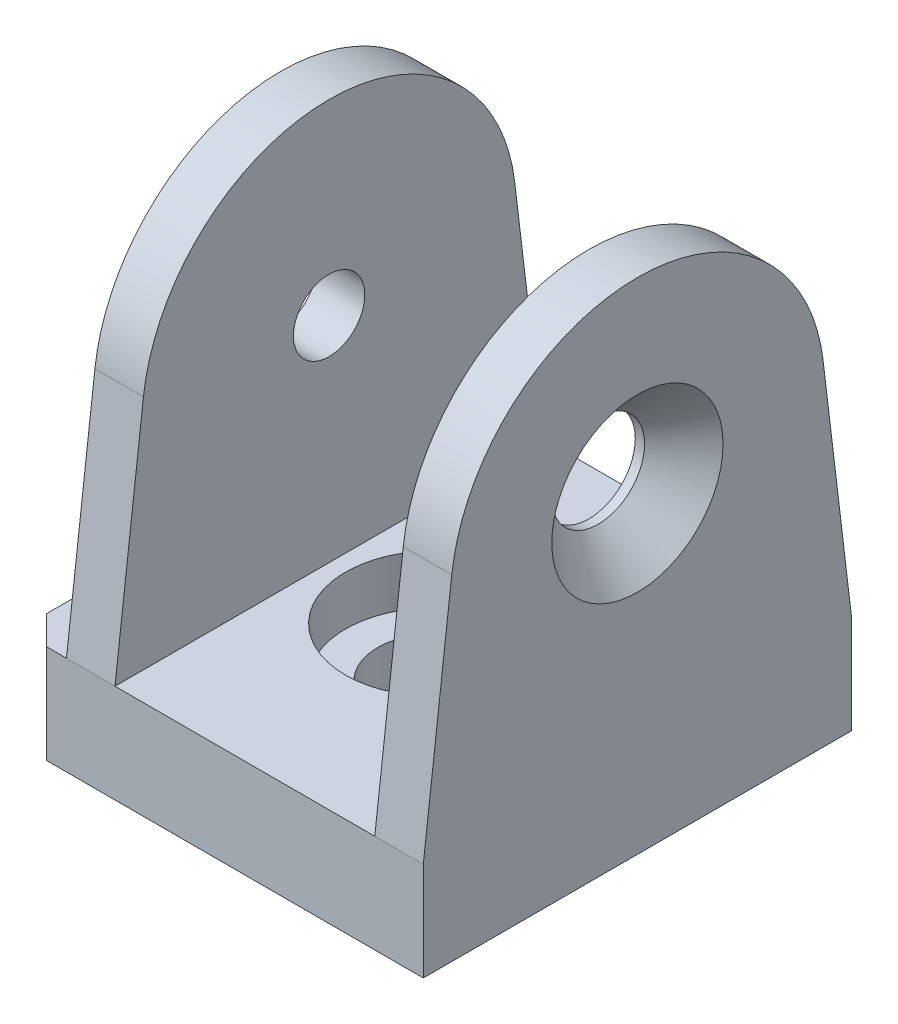
ISO-10303-21;
HEADER;
FILE_DESCRIPTION(('STEP AP214'),'2;1');
FILE_NAME('part.step','',(''),(''),'','','');
FILE_SCHEMA(('AUTOMOTIVE_DESIGN { 1 0 10303 214 1 1 1 1 }'));
ENDSEC;
DATA;
#1=APPLICATION_CONTEXT('core data for automotive mechanical design processes');
#2=APPLICATION_PROTOCOL_DEFINITION('international standard','automotive_design',2000,#1);
#3=PRODUCT_CONTEXT('',#1,'mechanical');
#4=PRODUCT('Part','Part','',(#3));
#5=PRODUCT_RELATED_PRODUCT_CATEGORY('part','',(#4));
#6=PRODUCT_DEFINITION_FORMATION('','',#4);
#7=PRODUCT_DEFINITION_CONTEXT('part definition',#1,'design');
#8=PRODUCT_DEFINITION('design','',#6,#7);
#9=PRODUCT_DEFINITION_SHAPE('','',#8);
#10=(LENGTH_UNIT() NAMED_UNIT(*) SI_UNIT(.MILLI.,.METRE.));
#11=(NAMED_UNIT(*) PLANE_ANGLE_UNIT() SI_UNIT($,.RADIAN.));
#12=(NAMED_UNIT(*) SI_UNIT($,.STERADIAN.) SOLID_ANGLE_UNIT());
#13=UNCERTAINTY_MEASURE_WITH_UNIT(LENGTH_MEASURE(1.E-05),#10,'distance_accuracy_value','');
#14=(GEOMETRIC_REPRESENTATION_CONTEXT(3) GLOBAL_UNCERTAINTY_ASSIGNED_CONTEXT((#13)) GLOBAL_UNIT_ASSIGNED_CONTEXT((#10,
#11,#12)) REPRESENTATION_CONTEXT('',''));
#15=CARTESIAN_POINT('',(0.,0.,0.));
#16=DIRECTION('',(0.,0.,1.));
#17=DIRECTION('',(1.,0.,0.));
#18=AXIS2_PLACEMENT_3D('',#15,#16,#17);
#19=CARTESIAN_POINT('',(-10.8,23.4654601413375,-13.0061268080041));
#20=DIRECTION('',(0.,0.119500774147898,-0.992834107481231));
#21=DIRECTION('',(0.,0.992834107481231,0.119500774147898));
#22=AXIS2_PLACEMENT_3D('',#19,#20,#21);
#23=PLANE('',#22);
#24=DIRECTION('',(0.,-0.992834107481231,-0.119500774147898));
#25=VECTOR('',#24,1.);
#26=CARTESIAN_POINT('',(10.8,23.4654601413375,-13.0061268080041));
#27=LINE('',#26,#25);
#28=CARTESIAN_POINT('',(10.8,23.4654601413374,-13.0061268080041));
#29=VERTEX_POINT('',#28);
#30=CARTESIAN_POINT('',(10.8,6.9,-15.));
#31=VERTEX_POINT('',#30);
#32=EDGE_CURVE('E145',#29,#31,#27,.T.);
#33=ORIENTED_EDGE('',*,*,#32,.F.);
#34=DIRECTION('',(1.,0.,0.));
#35=VECTOR('',#34,1.);
#36=CARTESIAN_POINT('',(-10.8,23.4654601413374,-13.0061268080041));
#37=LINE('',#36,#35);
#38=CARTESIAN_POINT('',(14.2,23.4654601413374,-13.0061268080041));
#39=VERTEX_POINT('',#38);
#40=EDGE_CURVE('E190',#29,#39,#37,.T.);
#41=ORIENTED_EDGE('',*,*,#40,.T.);
#42=DIRECTION('',(0.,0.992834107481231,0.119500774147898));
#43=VECTOR('',#42,1.);
#44=CARTESIAN_POINT('',(14.2,23.4654601413375,-13.0061268080041));
#45=LINE('',#44,#43);
#46=CARTESIAN_POINT('',(14.2,6.9,-15.));
#47=VERTEX_POINT('',#46);
#48=EDGE_CURVE('E258',#47,#39,#45,.T.);
#49=ORIENTED_EDGE('',*,*,#48,.F.);
#50=DIRECTION('',(-1.,0.,0.));
#51=VECTOR('',#50,1.);
#52=CARTESIAN_POINT('',(14.2,6.9,-15.));
#53=LINE('',#52,#51);
#54=EDGE_CURVE('E211',#47,#31,#53,.T.);
#55=ORIENTED_EDGE('',*,*,#54,.T.);
#56=EDGE_LOOP('',(#33,#41,#49,#55));
#57=FACE_BOUND('',#56,.T.);
#58=ADVANCED_FACE('F39',(#57),#23,.T.);
#59=CARTESIAN_POINT('',(-10.8,21.9,0.));
#60=DIRECTION('',(1.,0.,0.));
#61=DIRECTION('',(0.,0.,-1.));
#62=AXIS2_PLACEMENT_3D('',#59,#60,#61);
#63=CYLINDRICAL_SURFACE('',#62,13.1);
#64=DIRECTION('',(1.,0.,0.));
#65=VECTOR('',#64,1.);
#66=CARTESIAN_POINT('',(-10.8,23.4654601413375,13.0061268080041));
#67=LINE('',#66,#65);
#68=CARTESIAN_POINT('',(-10.8,23.4654601413375,13.0061268080041));
#69=VERTEX_POINT('',#68);
#70=CARTESIAN_POINT('',(-7.4,23.4654601413375,13.0061268080041));
#71=VERTEX_POINT('',#70);
#72=EDGE_CURVE('E178',#69,#71,#67,.T.);
#73=ORIENTED_EDGE('',*,*,#72,.T.);
#74=CARTESIAN_POINT('',(-7.4,21.9,0.));
#75=DIRECTION('',(-1.,0.,0.));
#76=DIRECTION('',(0.,-1.,0.));
#77=AXIS2_PLACEMENT_3D('',#74,#75,#76);
#78=CIRCLE('',#77,13.1);
#79=CARTESIAN_POINT('',(-7.4,23.4654601413374,-13.0061268080041));
#80=VERTEX_POINT('',#79);
#81=EDGE_CURVE('E149',#80,#71,#78,.F.);
#82=ORIENTED_EDGE('',*,*,#81,.F.);
#83=CARTESIAN_POINT('',(-10.8,23.4654601413374,-13.0061268080041));
#84=VERTEX_POINT('',#83);
#85=EDGE_CURVE('E187',#84,#80,#37,.T.);
#86=ORIENTED_EDGE('',*,*,#85,.F.);
#87=CARTESIAN_POINT('',(-10.8,21.9,0.));
#88=DIRECTION('',(1.,0.,0.));
#89=DIRECTION('',(0.,0.,1.));
#90=AXIS2_PLACEMENT_3D('',#87,#88,#89);
#91=CIRCLE('',#90,13.1);
#92=EDGE_CURVE('E313',#84,#69,#91,.T.);
#93=ORIENTED_EDGE('',*,*,#92,.T.);
#94=EDGE_LOOP('',(#73,#82,#86,#93));
#95=FACE_BOUND('',#94,.T.);
#96=ADVANCED_FACE('F273',(#95),#63,.T.);
#97=CARTESIAN_POINT('',(-10.8,6.9,15.));
#98=DIRECTION('',(0.,0.119500774147897,0.992834107481231));
#99=DIRECTION('',(0.,-0.992834107481231,0.119500774147897));
#100=AXIS2_PLACEMENT_3D('',#97,#98,#99);
#101=PLANE('',#100);
#102=DIRECTION('',(0.,0.992834107481231,-0.119500774147897));
#103=VECTOR('',#102,1.);
#104=CARTESIAN_POINT('',(10.8,6.9,15.));
#105=LINE('',#104,#103);
#106=CARTESIAN_POINT('',(10.8,6.9,15.));
#107=VERTEX_POINT('',#106);
#108=CARTESIAN_POINT('',(10.8,23.4654601413375,13.0061268080041));
#109=VERTEX_POINT('',#108);
#110=EDGE_CURVE('E142',#107,#109,#105,.T.);
#111=ORIENTED_EDGE('',*,*,#110,.F.);
#112=DIRECTION('',(1.,0.,0.));
#113=VECTOR('',#112,1.);
#114=CARTESIAN_POINT('',(-10.8,6.9,15.));
#115=LINE('',#114,#113);
#116=CARTESIAN_POINT('',(14.2,6.9,15.));
#117=VERTEX_POINT('',#116);
#118=EDGE_CURVE('E167',#107,#117,#115,.T.);
#119=ORIENTED_EDGE('',*,*,#118,.T.);
#120=DIRECTION('',(0.,-0.992834107481231,0.119500774147897));
#121=VECTOR('',#120,1.);
#122=CARTESIAN_POINT('',(14.2,6.9,15.));
#123=LINE('',#122,#121);
#124=CARTESIAN_POINT('',(14.2,23.4654601413375,13.0061268080041));
#125=VERTEX_POINT('',#124);
#126=EDGE_CURVE('E184',#125,#117,#123,.T.);
#127=ORIENTED_EDGE('',*,*,#126,.F.);
#128=EDGE_CURVE('E169',#109,#125,#67,.T.);
#129=ORIENTED_EDGE('',*,*,#128,.F.);
#130=EDGE_LOOP('',(#111,#119,#127,#129));
#131=FACE_BOUND('',#130,.T.);
#132=ADVANCED_FACE('F165',(#131),#101,.T.);
#133=CARTESIAN_POINT('',(0.,6.9,0.));
#134=DIRECTION('',(0.,1.,0.));
#135=DIRECTION('',(0.,0.,1.));
#136=AXIS2_PLACEMENT_3D('',#133,#134,#135);
#137=PLANE('',#136);
#138=CARTESIAN_POINT('',(-10.8,6.9,-15.));
#139=VERTEX_POINT('',#138);
#140=CARTESIAN_POINT('',(-12.2,6.9,-15.));
#141=VERTEX_POINT('',#140);
#142=EDGE_CURVE('E210',#139,#141,#53,.T.);
#143=ORIENTED_EDGE('',*,*,#142,.T.);
#144=DIRECTION('',(0.707106781186549,0.,-0.707106781186546));
#145=VECTOR('',#144,1.);
#146=CARTESIAN_POINT('',(-13.6,6.9,-13.6));
#147=LINE('',#146,#145);
#148=CARTESIAN_POINT('',(-14.2,6.9,-13.));
#149=VERTEX_POINT('',#148);
#150=EDGE_CURVE('E48',#141,#149,#147,.F.);
#151=ORIENTED_EDGE('',*,*,#150,.T.);
#152=DIRECTION('',(0.,0.,1.));
#153=VECTOR('',#152,1.);
#154=CARTESIAN_POINT('',(-14.2,6.9,15.));
#155=LINE('',#154,#153);
#156=CARTESIAN_POINT('',(-14.2,6.9,13.));
#157=VERTEX_POINT('',#156);
#158=EDGE_CURVE('E205',#149,#157,#155,.T.);
#159=ORIENTED_EDGE('',*,*,#158,.T.);
#160=DIRECTION('',(-0.707106781186547,0.,-0.707106781186548));
#161=VECTOR('',#160,1.);
#162=CARTESIAN_POINT('',(-13.6,6.9,13.6));
#163=LINE('',#162,#161);
#164=CARTESIAN_POINT('',(-12.2,6.9,15.));
#165=VERTEX_POINT('',#164);
#166=EDGE_CURVE('E55',#157,#165,#163,.F.);
#167=ORIENTED_EDGE('',*,*,#166,.T.);
#168=DIRECTION('',(1.,0.,0.));
#169=VECTOR('',#168,1.);
#170=CARTESIAN_POINT('',(14.2,6.9,15.));
#171=LINE('',#170,#169);
#172=CARTESIAN_POINT('',(-10.8,6.9,15.));
#173=VERTEX_POINT('',#172);
#174=EDGE_CURVE('E207',#165,#173,#171,.T.);
#175=ORIENTED_EDGE('',*,*,#174,.T.);
#176=DIRECTION('',(0.,0.,-1.));
#177=VECTOR('',#176,1.);
#178=CARTESIAN_POINT('',(-10.8,6.9,-15.));
#179=LINE('',#178,#177);
#180=EDGE_CURVE('E318',#173,#139,#179,.T.);
#181=ORIENTED_EDGE('',*,*,#180,.T.);
#182=EDGE_LOOP('',(#143,#151,#159,#167,#175,#181));
#183=FACE_BOUND('',#182,.T.);
#184=ADVANCED_FACE('F238',(#183),#137,.T.);
#185=CARTESIAN_POINT('',(-14.2,6.9,15.));
#186=DIRECTION('',(1.,0.,0.));
#187=DIRECTION('',(0.,0.,-1.));
#188=AXIS2_PLACEMENT_3D('',#185,#186,#187);
#189=PLANE('',#188);
#190=ORIENTED_EDGE('',*,*,#158,.F.);
#191=DIRECTION('',(0.,-1.,0.));
#192=VECTOR('',#191,1.);
#193=CARTESIAN_POINT('',(-14.2,6.9,-13.));
#194=LINE('',#193,#192);
#195=CARTESIAN_POINT('',(-14.2,0.,-13.));
#196=VERTEX_POINT('',#195);
#197=EDGE_CURVE('E228',#149,#196,#194,.T.);
#198=ORIENTED_EDGE('',*,*,#197,.T.);
#199=DIRECTION('',(0.,0.,1.));
#200=VECTOR('',#199,1.);
#201=CARTESIAN_POINT('',(-14.2,0.,15.));
#202=LINE('',#201,#200);
#203=CARTESIAN_POINT('',(-14.2,0.,13.));
#204=VERTEX_POINT('',#203);
#205=EDGE_CURVE('E204',#196,#204,#202,.T.);
#206=ORIENTED_EDGE('',*,*,#205,.T.);
#207=DIRECTION('',(0.,1.,0.));
#208=VECTOR('',#207,1.);
#209=CARTESIAN_POINT('',(-14.2,6.9,13.));
#210=LINE('',#209,#208);
#211=EDGE_CURVE('E170',#204,#157,#210,.T.);
#212=ORIENTED_EDGE('',*,*,#211,.T.);
#213=EDGE_LOOP('',(#190,#198,#206,#212));
#214=FACE_BOUND('',#213,.T.);
#215=ADVANCED_FACE('F243',(#214),#189,.F.);
#216=CARTESIAN_POINT('',(14.2,6.9,15.));
#217=DIRECTION('',(0.,0.,-1.));
#218=DIRECTION('',(-1.,0.,0.));
#219=AXIS2_PLACEMENT_3D('',#216,#217,#218);
#220=PLANE('',#219);
#221=ORIENTED_EDGE('',*,*,#174,.F.);
#222=DIRECTION('',(0.,-1.,0.));
#223=VECTOR('',#222,1.);
#224=CARTESIAN_POINT('',(-12.2,6.9,15.));
#225=LINE('',#224,#223);
#226=CARTESIAN_POINT('',(-12.2,0.,15.));
#227=VERTEX_POINT('',#226);
#228=EDGE_CURVE('E11',#165,#227,#225,.T.);
#229=ORIENTED_EDGE('',*,*,#228,.T.);
#230=DIRECTION('',(1.,0.,0.));
#231=VECTOR('',#230,1.);
#232=CARTESIAN_POINT('',(14.2,0.,15.));
#233=LINE('',#232,#231);
#234=CARTESIAN_POINT('',(14.2,0.,15.));
#235=VERTEX_POINT('',#234);
#236=EDGE_CURVE('E218',#227,#235,#233,.T.);
#237=ORIENTED_EDGE('',*,*,#236,.T.);
#238=DIRECTION('',(0.,-1.,0.));
#239=VECTOR('',#238,1.);
#240=CARTESIAN_POINT('',(14.2,6.9,15.));
#241=LINE('',#240,#239);
#242=EDGE_CURVE('E176',#117,#235,#241,.T.);
#243=ORIENTED_EDGE('',*,*,#242,.F.);
#244=ORIENTED_EDGE('',*,*,#118,.F.);
#245=DIRECTION('',(1.,0.,0.));
#246=VECTOR('',#245,1.);
#247=CARTESIAN_POINT('',(10.8,6.9,15.));
#248=LINE('',#247,#246);
#249=CARTESIAN_POINT('',(-7.4,6.9,15.));
#250=VERTEX_POINT('',#249);
#251=EDGE_CURVE('E153',#250,#107,#248,.T.);
#252=ORIENTED_EDGE('',*,*,#251,.F.);
#253=EDGE_CURVE('E177',#173,#250,#115,.T.);
#254=ORIENTED_EDGE('',*,*,#253,.F.);
#255=EDGE_LOOP('',(#221,#229,#237,#243,#244,#252,#254));
#256=FACE_BOUND('',#255,.T.);
#257=ADVANCED_FACE('F174',(#256),#220,.F.);
#258=CARTESIAN_POINT('',(14.2,6.9,15.));
#259=DIRECTION('',(-1.,0.,0.));
#260=DIRECTION('',(0.,0.,1.));
#261=AXIS2_PLACEMENT_3D('',#258,#259,#260);
#262=PLANE('',#261);
#263=CARTESIAN_POINT('',(14.2,21.9,0.));
#264=DIRECTION('',(1.,0.,0.));
#265=DIRECTION('',(0.,0.,-1.));
#266=AXIS2_PLACEMENT_3D('',#263,#264,#265);
#267=CIRCLE('',#266,6.);
#268=CARTESIAN_POINT('',(14.2,21.9,-6.));
#269=VERTEX_POINT('',#268);
#270=EDGE_CURVE('E334',#269,#269,#267,.T.);
#271=ORIENTED_EDGE('',*,*,#270,.F.);
#272=EDGE_LOOP('',(#271));
#273=FACE_BOUND('',#272,.T.);
#274=DIRECTION('',(0.,0.,-1.));
#275=VECTOR('',#274,1.);
#276=CARTESIAN_POINT('',(14.2,0.,15.));
#277=LINE('',#276,#275);
#278=CARTESIAN_POINT('',(14.2,0.,-15.));
#279=VERTEX_POINT('',#278);
#280=EDGE_CURVE('E220',#235,#279,#277,.T.);
#281=ORIENTED_EDGE('',*,*,#280,.T.);
#282=DIRECTION('',(0.,-1.,0.));
#283=VECTOR('',#282,1.);
#284=CARTESIAN_POINT('',(14.2,6.9,-15.));
#285=LINE('',#284,#283);
#286=EDGE_CURVE('E214',#47,#279,#285,.T.);
#287=ORIENTED_EDGE('',*,*,#286,.F.);
#288=ORIENTED_EDGE('',*,*,#48,.T.);
#289=CARTESIAN_POINT('',(14.2,21.9,0.));
#290=DIRECTION('',(1.,0.,0.));
#291=DIRECTION('',(0.,0.,1.));
#292=AXIS2_PLACEMENT_3D('',#289,#290,#291);
#293=CIRCLE('',#292,13.1);
#294=EDGE_CURVE('E306',#39,#125,#293,.T.);
#295=ORIENTED_EDGE('',*,*,#294,.T.);
#296=ORIENTED_EDGE('',*,*,#126,.T.);
#297=ORIENTED_EDGE('',*,*,#242,.T.);
#298=EDGE_LOOP('',(#281,#287,#288,#295,#296,#297));
#299=FACE_BOUND('',#298,.T.);
#300=ADVANCED_FACE('F256',(#273,#299),#262,.F.);
#301=CARTESIAN_POINT('',(14.2,6.9,-15.));
#302=DIRECTION('',(0.,0.,1.));
#303=DIRECTION('',(1.,0.,0.));
#304=AXIS2_PLACEMENT_3D('',#301,#302,#303);
#305=PLANE('',#304);
#306=DIRECTION('',(-1.,0.,0.));
#307=VECTOR('',#306,1.);
#308=CARTESIAN_POINT('',(14.2,0.,-15.));
#309=LINE('',#308,#307);
#310=CARTESIAN_POINT('',(-12.2,0.,-15.));
#311=VERTEX_POINT('',#310);
#312=EDGE_CURVE('E208',#279,#311,#309,.T.);
#313=ORIENTED_EDGE('',*,*,#312,.T.);
#314=DIRECTION('',(0.,1.,0.));
#315=VECTOR('',#314,1.);
#316=CARTESIAN_POINT('',(-12.2,6.9,-15.));
#317=LINE('',#316,#315);
#318=EDGE_CURVE('E63',#311,#141,#317,.T.);
#319=ORIENTED_EDGE('',*,*,#318,.T.);
#320=ORIENTED_EDGE('',*,*,#142,.F.);
#321=CARTESIAN_POINT('',(-7.4,6.9,-15.));
#322=VERTEX_POINT('',#321);
#323=EDGE_CURVE('E215',#322,#139,#53,.T.);
#324=ORIENTED_EDGE('',*,*,#323,.F.);
#325=DIRECTION('',(1.,0.,0.));
#326=VECTOR('',#325,1.);
#327=CARTESIAN_POINT('',(10.8,6.9,-15.));
#328=LINE('',#327,#326);
#329=EDGE_CURVE('E161',#322,#31,#328,.T.);
#330=ORIENTED_EDGE('',*,*,#329,.T.);
#331=ORIENTED_EDGE('',*,*,#54,.F.);
#332=ORIENTED_EDGE('',*,*,#286,.T.);
#333=EDGE_LOOP('',(#313,#319,#320,#324,#330,#331,#332));
#334=FACE_BOUND('',#333,.T.);
#335=ADVANCED_FACE('F251',(#334),#305,.F.);
#336=CARTESIAN_POINT('',(0.,0.,0.));
#337=DIRECTION('',(0.,1.,0.));
#338=DIRECTION('',(0.,0.,1.));
#339=AXIS2_PLACEMENT_3D('',#336,#337,#338);
#340=PLANE('',#339);
#341=CARTESIAN_POINT('',(0.,0.,0.));
#342=DIRECTION('',(0.,1.,0.));
#343=DIRECTION('',(0.,0.,1.));
#344=AXIS2_PLACEMENT_3D('',#341,#342,#343);
#345=CIRCLE('',#344,4.);
#346=CARTESIAN_POINT('',(0.,0.,4.));
#347=VERTEX_POINT('',#346);
#348=EDGE_CURVE('E201',#347,#347,#345,.T.);
#349=ORIENTED_EDGE('',*,*,#348,.T.);
#350=EDGE_LOOP('',(#349));
#351=FACE_BOUND('',#350,.T.);
#352=ORIENTED_EDGE('',*,*,#205,.F.);
#353=DIRECTION('',(-0.707106781186549,0.,0.707106781186546));
#354=VECTOR('',#353,1.);
#355=CARTESIAN_POINT('',(-14.2,0.,-13.));
#356=LINE('',#355,#354);
#357=EDGE_CURVE('E233',#196,#311,#356,.F.);
#358=ORIENTED_EDGE('',*,*,#357,.T.);
#359=ORIENTED_EDGE('',*,*,#312,.F.);
#360=ORIENTED_EDGE('',*,*,#280,.F.);
#361=ORIENTED_EDGE('',*,*,#236,.F.);
#362=DIRECTION('',(0.707106781186547,0.,0.707106781186548));
#363=VECTOR('',#362,1.);
#364=CARTESIAN_POINT('',(-12.2,0.,15.));
#365=LINE('',#364,#363);
#366=EDGE_CURVE('E231',#227,#204,#365,.F.);
#367=ORIENTED_EDGE('',*,*,#366,.T.);
#368=EDGE_LOOP('',(#352,#358,#359,#360,#361,#367));
#369=FACE_BOUND('',#368,.T.);
#370=ADVANCED_FACE('F249',(#351,#369),#340,.F.);
#371=CARTESIAN_POINT('',(0.,6.9,0.));
#372=DIRECTION('',(0.,1.,0.));
#373=DIRECTION('',(0.,0.,1.));
#374=AXIS2_PLACEMENT_3D('',#371,#372,#373);
#375=CYLINDRICAL_SURFACE('',#374,4.);
#376=ORIENTED_EDGE('',*,*,#348,.F.);
#377=EDGE_LOOP('',(#376));
#378=FACE_BOUND('',#377,.T.);
#379=CARTESIAN_POINT('',(0.,3.45,0.));
#380=DIRECTION('',(0.,1.,0.));
#381=DIRECTION('',(0.,0.,1.));
#382=AXIS2_PLACEMENT_3D('',#379,#380,#381);
#383=CIRCLE('',#382,4.);
#384=CARTESIAN_POINT('',(0.,3.45,4.));
#385=VERTEX_POINT('',#384);
#386=EDGE_CURVE('E198',#385,#385,#383,.T.);
#387=ORIENTED_EDGE('',*,*,#386,.T.);
#388=EDGE_LOOP('',(#387));
#389=FACE_BOUND('',#388,.T.);
#390=ADVANCED_FACE('F365',(#378,#389),#375,.F.);
#391=CARTESIAN_POINT('',(-4.,3.45,0.));
#392=DIRECTION('',(0.,-1.,0.));
#393=DIRECTION('',(0.,0.,-1.));
#394=AXIS2_PLACEMENT_3D('',#391,#392,#393);
#395=PLANE('',#394);
#396=ORIENTED_EDGE('',*,*,#386,.F.);
#397=EDGE_LOOP('',(#396));
#398=FACE_BOUND('',#397,.T.);
#399=CARTESIAN_POINT('',(0.,3.45,0.));
#400=DIRECTION('',(0.,1.,0.));
#401=DIRECTION('',(0.,0.,1.));
#402=AXIS2_PLACEMENT_3D('',#399,#400,#401);
#403=CIRCLE('',#402,6.25);
#404=CARTESIAN_POINT('',(0.,3.45,6.25));
#405=VERTEX_POINT('',#404);
#406=EDGE_CURVE('E180',#405,#405,#403,.T.);
#407=ORIENTED_EDGE('',*,*,#406,.T.);
#408=EDGE_LOOP('',(#407));
#409=FACE_BOUND('',#408,.T.);
#410=ADVANCED_FACE('F372',(#398,#409),#395,.F.);
#411=CARTESIAN_POINT('',(0.,6.9,0.));
#412=DIRECTION('',(0.,1.,0.));
#413=DIRECTION('',(0.,0.,1.));
#414=AXIS2_PLACEMENT_3D('',#411,#412,#413);
#415=CYLINDRICAL_SURFACE('',#414,6.25);
#416=ORIENTED_EDGE('',*,*,#406,.F.);
#417=EDGE_LOOP('',(#416));
#418=FACE_BOUND('',#417,.T.);
#419=CARTESIAN_POINT('',(0.,6.9,0.));
#420=DIRECTION('',(0.,1.,0.));
#421=DIRECTION('',(0.,0.,1.));
#422=AXIS2_PLACEMENT_3D('',#419,#420,#421);
#423=CIRCLE('',#422,6.25);
#424=CARTESIAN_POINT('',(0.,6.9,6.25));
#425=VERTEX_POINT('',#424);
#426=EDGE_CURVE('E191',#425,#425,#423,.T.);
#427=ORIENTED_EDGE('',*,*,#426,.T.);
#428=EDGE_LOOP('',(#427));
#429=FACE_BOUND('',#428,.T.);
#430=ADVANCED_FACE('F293',(#418,#429),#415,.F.);
#431=CARTESIAN_POINT('',(-10.8,21.9,0.));
#432=DIRECTION('',(-1.,0.,0.));
#433=DIRECTION('',(0.,0.,1.));
#434=AXIS2_PLACEMENT_3D('',#431,#432,#433);
#435=PLANE('',#434);
#436=CARTESIAN_POINT('',(-10.8,21.9,0.));
#437=DIRECTION('',(-1.,0.,0.));
#438=DIRECTION('',(0.,0.,1.));
#439=AXIS2_PLACEMENT_3D('',#436,#437,#438);
#440=CIRCLE('',#439,2.5);
#441=CARTESIAN_POINT('',(-10.8,21.9,2.5));
#442=VERTEX_POINT('',#441);
#443=EDGE_CURVE('E325',#442,#442,#440,.T.);
#444=ORIENTED_EDGE('',*,*,#443,.F.);
#445=EDGE_LOOP('',(#444));
#446=FACE_BOUND('',#445,.T.);
#447=ORIENTED_EDGE('',*,*,#180,.F.);
#448=DIRECTION('',(0.,-0.992834107481231,0.119500774147897));
#449=VECTOR('',#448,1.);
#450=CARTESIAN_POINT('',(-10.8,6.9,15.));
#451=LINE('',#450,#449);
#452=EDGE_CURVE('E310',#69,#173,#451,.T.);
#453=ORIENTED_EDGE('',*,*,#452,.F.);
#454=ORIENTED_EDGE('',*,*,#92,.F.);
#455=DIRECTION('',(0.,0.992834107481231,0.119500774147898));
#456=VECTOR('',#455,1.);
#457=CARTESIAN_POINT('',(-10.8,23.4654601413375,-13.0061268080041));
#458=LINE('',#457,#456);
#459=EDGE_CURVE('E316',#139,#84,#458,.T.);
#460=ORIENTED_EDGE('',*,*,#459,.F.);
#461=EDGE_LOOP('',(#447,#453,#454,#460));
#462=FACE_BOUND('',#461,.T.);
#463=ADVANCED_FACE('F285',(#446,#462),#435,.T.);
#464=DIRECTION('',(0.,0.992834107481231,0.119500774147898));
#465=VECTOR('',#464,1.);
#466=CARTESIAN_POINT('',(-7.4,23.4654601413375,-13.0061268080041));
#467=LINE('',#466,#465);
#468=EDGE_CURVE('E195',#322,#80,#467,.T.);
#469=ORIENTED_EDGE('',*,*,#468,.F.);
#470=ORIENTED_EDGE('',*,*,#323,.T.);
#471=ORIENTED_EDGE('',*,*,#459,.T.);
#472=ORIENTED_EDGE('',*,*,#85,.T.);
#473=EDGE_LOOP('',(#469,#470,#471,#472));
#474=FACE_BOUND('',#473,.T.);
#475=ADVANCED_FACE('F276',(#474),#23,.T.);
#476=CARTESIAN_POINT('',(10.8,21.9,0.));
#477=DIRECTION('',(1.,0.,0.));
#478=DIRECTION('',(0.,0.,-1.));
#479=AXIS2_PLACEMENT_3D('',#476,#477,#478);
#480=CIRCLE('',#479,13.1);
#481=EDGE_CURVE('E194',#109,#29,#480,.F.);
#482=ORIENTED_EDGE('',*,*,#481,.F.);
#483=ORIENTED_EDGE('',*,*,#128,.T.);
#484=ORIENTED_EDGE('',*,*,#294,.F.);
#485=ORIENTED_EDGE('',*,*,#40,.F.);
#486=EDGE_LOOP('',(#482,#483,#484,#485));
#487=FACE_BOUND('',#486,.T.);
#488=ADVANCED_FACE('F282',(#487),#63,.T.);
#489=DIRECTION('',(0.,-0.992834107481231,0.119500774147897));
#490=VECTOR('',#489,1.);
#491=CARTESIAN_POINT('',(-7.4,6.9,15.));
#492=LINE('',#491,#490);
#493=EDGE_CURVE('E171',#71,#250,#492,.T.);
#494=ORIENTED_EDGE('',*,*,#493,.F.);
#495=ORIENTED_EDGE('',*,*,#72,.F.);
#496=ORIENTED_EDGE('',*,*,#452,.T.);
#497=ORIENTED_EDGE('',*,*,#253,.T.);
#498=EDGE_LOOP('',(#494,#495,#496,#497));
#499=FACE_BOUND('',#498,.T.);
#500=ADVANCED_FACE('F291',(#499),#101,.T.);
#501=CARTESIAN_POINT('',(10.8,6.9,-15.));
#502=DIRECTION('',(0.,-1.,0.));
#503=DIRECTION('',(1.,0.,0.));
#504=AXIS2_PLACEMENT_3D('',#501,#502,#503);
#505=PLANE('',#504);
#506=DIRECTION('',(0.,0.,1.));
#507=VECTOR('',#506,1.);
#508=CARTESIAN_POINT('',(10.8,6.9,-15.));
#509=LINE('',#508,#507);
#510=EDGE_CURVE('E138',#31,#107,#509,.T.);
#511=ORIENTED_EDGE('',*,*,#510,.F.);
#512=ORIENTED_EDGE('',*,*,#329,.F.);
#513=DIRECTION('',(0.,0.,1.));
#514=VECTOR('',#513,1.);
#515=CARTESIAN_POINT('',(-7.4,6.9,-15.));
#516=LINE('',#515,#514);
#517=EDGE_CURVE('E150',#322,#250,#516,.T.);
#518=ORIENTED_EDGE('',*,*,#517,.T.);
#519=ORIENTED_EDGE('',*,*,#251,.T.);
#520=EDGE_LOOP('',(#511,#512,#518,#519));
#521=FACE_BOUND('',#520,.T.);
#522=ORIENTED_EDGE('',*,*,#426,.F.);
#523=EDGE_LOOP('',(#522));
#524=FACE_BOUND('',#523,.T.);
#525=ADVANCED_FACE('F154',(#521,#524),#505,.F.);
#526=CARTESIAN_POINT('',(10.8,6.9,-15.));
#527=DIRECTION('',(1.,0.,0.));
#528=DIRECTION('',(0.,0.,-1.));
#529=AXIS2_PLACEMENT_3D('',#526,#527,#528);
#530=PLANE('',#529);
#531=CARTESIAN_POINT('',(10.8,21.9,0.));
#532=DIRECTION('',(1.,0.,0.));
#533=DIRECTION('',(0.,0.,-1.));
#534=AXIS2_PLACEMENT_3D('',#531,#532,#533);
#535=CIRCLE('',#534,3.25);
#536=CARTESIAN_POINT('',(10.8,21.9,-3.25));
#537=VERTEX_POINT('',#536);
#538=EDGE_CURVE('E328',#537,#537,#535,.T.);
#539=ORIENTED_EDGE('',*,*,#538,.T.);
#540=EDGE_LOOP('',(#539));
#541=FACE_BOUND('',#540,.T.);
#542=ORIENTED_EDGE('',*,*,#32,.T.);
#543=ORIENTED_EDGE('',*,*,#510,.T.);
#544=ORIENTED_EDGE('',*,*,#110,.T.);
#545=ORIENTED_EDGE('',*,*,#481,.T.);
#546=EDGE_LOOP('',(#542,#543,#544,#545));
#547=FACE_BOUND('',#546,.T.);
#548=ADVANCED_FACE('F140',(#541,#547),#530,.F.);
#549=CARTESIAN_POINT('',(-7.4,6.9,-15.));
#550=DIRECTION('',(-1.,0.,0.));
#551=DIRECTION('',(0.,-1.,0.));
#552=AXIS2_PLACEMENT_3D('',#549,#550,#551);
#553=PLANE('',#552);
#554=CARTESIAN_POINT('',(-7.4,21.9,0.));
#555=DIRECTION('',(-1.,0.,0.));
#556=DIRECTION('',(0.,-1.,0.));
#557=AXIS2_PLACEMENT_3D('',#554,#555,#556);
#558=CIRCLE('',#557,2.5);
#559=CARTESIAN_POINT('',(-7.4,19.4,0.));
#560=VERTEX_POINT('',#559);
#561=EDGE_CURVE('E162',#560,#560,#558,.T.);
#562=ORIENTED_EDGE('',*,*,#561,.T.);
#563=EDGE_LOOP('',(#562));
#564=FACE_BOUND('',#563,.T.);
#565=ORIENTED_EDGE('',*,*,#468,.T.);
#566=ORIENTED_EDGE('',*,*,#81,.T.);
#567=ORIENTED_EDGE('',*,*,#493,.T.);
#568=ORIENTED_EDGE('',*,*,#517,.F.);
#569=EDGE_LOOP('',(#565,#566,#567,#568));
#570=FACE_BOUND('',#569,.T.);
#571=ADVANCED_FACE('F271',(#564,#570),#553,.F.);
#572=CARTESIAN_POINT('',(-14.2,6.9,-13.));
#573=DIRECTION('',(0.707106781186546,0.,0.707106781186549));
#574=DIRECTION('',(0.,-1.,0.));
#575=AXIS2_PLACEMENT_3D('',#572,#573,#574);
#576=PLANE('',#575);
#577=ORIENTED_EDGE('',*,*,#150,.F.);
#578=ORIENTED_EDGE('',*,*,#318,.F.);
#579=ORIENTED_EDGE('',*,*,#357,.F.);
#580=ORIENTED_EDGE('',*,*,#197,.F.);
#581=EDGE_LOOP('',(#577,#578,#579,#580));
#582=FACE_BOUND('',#581,.T.);
#583=ADVANCED_FACE('F246',(#582),#576,.F.);
#584=CARTESIAN_POINT('',(-12.2,6.9,15.));
#585=DIRECTION('',(0.707106781186548,0.,-0.707106781186547));
#586=DIRECTION('',(0.,-1.,0.));
#587=AXIS2_PLACEMENT_3D('',#584,#585,#586);
#588=PLANE('',#587);
#589=ORIENTED_EDGE('',*,*,#166,.F.);
#590=ORIENTED_EDGE('',*,*,#211,.F.);
#591=ORIENTED_EDGE('',*,*,#366,.F.);
#592=ORIENTED_EDGE('',*,*,#228,.F.);
#593=EDGE_LOOP('',(#589,#590,#591,#592));
#594=FACE_BOUND('',#593,.T.);
#595=ADVANCED_FACE('F42',(#594),#588,.F.);
#596=CARTESIAN_POINT('',(-10.8,21.9,0.));
#597=DIRECTION('',(-1.,0.,0.));
#598=DIRECTION('',(0.,0.,1.));
#599=AXIS2_PLACEMENT_3D('',#596,#597,#598);
#600=CYLINDRICAL_SURFACE('',#599,2.5);
#601=ORIENTED_EDGE('',*,*,#561,.F.);
#602=EDGE_LOOP('',(#601));
#603=FACE_BOUND('',#602,.T.);
#604=ORIENTED_EDGE('',*,*,#443,.T.);
#605=EDGE_LOOP('',(#604));
#606=FACE_BOUND('',#605,.T.);
#607=ADVANCED_FACE('F263',(#603,#606),#600,.F.);
#608=CARTESIAN_POINT('',(14.2,21.9,0.));
#609=DIRECTION('',(1.,0.,0.));
#610=DIRECTION('',(0.,0.,-1.));
#611=AXIS2_PLACEMENT_3D('',#608,#609,#610);
#612=CYLINDRICAL_SURFACE('',#611,3.25);
#613=ORIENTED_EDGE('',*,*,#538,.F.);
#614=EDGE_LOOP('',(#613));
#615=FACE_BOUND('',#614,.T.);
#616=CARTESIAN_POINT('',(11.45,21.9,0.));
#617=DIRECTION('',(1.,0.,0.));
#618=DIRECTION('',(0.,0.,-1.));
#619=AXIS2_PLACEMENT_3D('',#616,#617,#618);
#620=CIRCLE('',#619,3.25);
#621=CARTESIAN_POINT('',(11.45,21.9,-3.25));
#622=VERTEX_POINT('',#621);
#623=EDGE_CURVE('E331',#622,#622,#620,.T.);
#624=ORIENTED_EDGE('',*,*,#623,.T.);
#625=EDGE_LOOP('',(#624));
#626=FACE_BOUND('',#625,.T.);
#627=ADVANCED_FACE('F268',(#615,#626),#612,.F.);
#628=CARTESIAN_POINT('',(14.2,21.9,0.));
#629=DIRECTION('',(1.,0.,0.));
#630=DIRECTION('',(0.,0.,-1.));
#631=AXIS2_PLACEMENT_3D('',#628,#629,#630);
#632=CONICAL_SURFACE('',#631,6.,0.785398163397448);
#633=ORIENTED_EDGE('',*,*,#623,.F.);
#634=EDGE_LOOP('',(#633));
#635=FACE_BOUND('',#634,.T.);
#636=ORIENTED_EDGE('',*,*,#270,.T.);
#637=EDGE_LOOP('',(#636));
#638=FACE_BOUND('',#637,.T.);
#639=ADVANCED_FACE('F338',(#635,#638),#632,.F.);
#640=CLOSED_SHELL('',(#58,#96,#132,#184,#215,#257,#300,#335,#370,#390,#410,#430,#463,#475,#488,
#500,#525,#548,#571,#583,#595,#607,#627,#639));
#641=MANIFOLD_SOLID_BREP('B2',#640);
#642=ADVANCED_BREP_SHAPE_REPRESENTATION('',(#18,#641),#14);
#643=SHAPE_DEFINITION_REPRESENTATION(#9,#642);
ENDSEC;
END-ISO-10303-21;
